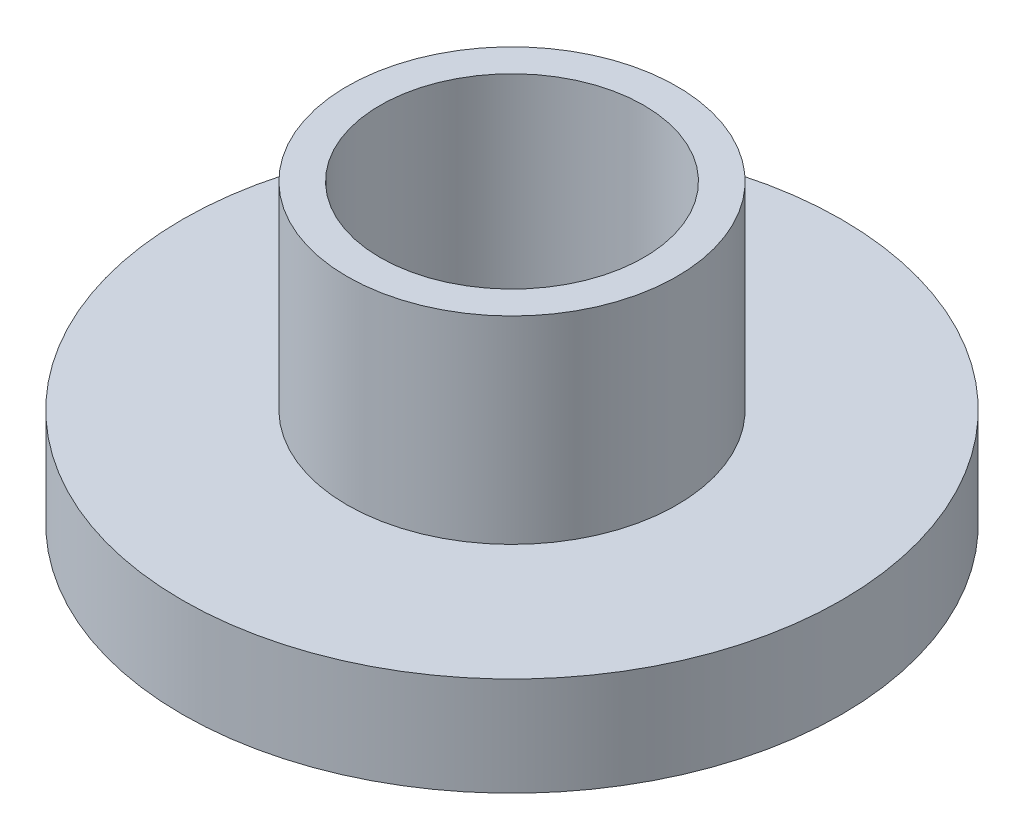
ISO-10303-21;
HEADER;
FILE_DESCRIPTION(('STEP AP214'),'2;1');
FILE_NAME('part.step','',(''),(''),'','','');
FILE_SCHEMA(('AUTOMOTIVE_DESIGN { 1 0 10303 214 1 1 1 1 }'));
ENDSEC;
DATA;
#1=APPLICATION_CONTEXT('core data for automotive mechanical design processes');
#2=APPLICATION_PROTOCOL_DEFINITION('international standard','automotive_design',2000,#1);
#3=PRODUCT_CONTEXT('',#1,'mechanical');
#4=PRODUCT('Part','Part','',(#3));
#5=PRODUCT_RELATED_PRODUCT_CATEGORY('part','',(#4));
#6=PRODUCT_DEFINITION_FORMATION('','',#4);
#7=PRODUCT_DEFINITION_CONTEXT('part definition',#1,'design');
#8=PRODUCT_DEFINITION('design','',#6,#7);
#9=PRODUCT_DEFINITION_SHAPE('','',#8);
#10=(LENGTH_UNIT() NAMED_UNIT(*) SI_UNIT(.MILLI.,.METRE.));
#11=(NAMED_UNIT(*) PLANE_ANGLE_UNIT() SI_UNIT($,.RADIAN.));
#12=(NAMED_UNIT(*) SI_UNIT($,.STERADIAN.) SOLID_ANGLE_UNIT());
#13=UNCERTAINTY_MEASURE_WITH_UNIT(LENGTH_MEASURE(1.E-05),#10,'distance_accuracy_value','');
#14=(GEOMETRIC_REPRESENTATION_CONTEXT(3) GLOBAL_UNCERTAINTY_ASSIGNED_CONTEXT((#13)) GLOBAL_UNIT_ASSIGNED_CONTEXT((#10,
#11,#12)) REPRESENTATION_CONTEXT('',''));
#15=CARTESIAN_POINT('',(0.,0.,0.));
#16=DIRECTION('',(0.,0.,1.));
#17=DIRECTION('',(1.,0.,0.));
#18=AXIS2_PLACEMENT_3D('',#15,#16,#17);
#19=CARTESIAN_POINT('',(0.,1.5,0.));
#20=DIRECTION('',(0.,1.,0.));
#21=DIRECTION('',(0.,0.,1.));
#22=AXIS2_PLACEMENT_3D('',#19,#20,#21);
#23=PLANE('',#22);
#24=CARTESIAN_POINT('',(0.,1.5,0.));
#25=DIRECTION('',(0.,1.,0.));
#26=DIRECTION('',(0.,0.,1.));
#27=AXIS2_PLACEMENT_3D('',#24,#25,#26);
#28=CIRCLE('',#27,5.);
#29=CARTESIAN_POINT('',(0.,1.5,5.));
#30=VERTEX_POINT('',#29);
#31=EDGE_CURVE('E10',#30,#30,#28,.T.);
#32=ORIENTED_EDGE('',*,*,#31,.T.);
#33=EDGE_LOOP('',(#32));
#34=FACE_BOUND('',#33,.T.);
#35=CARTESIAN_POINT('',(0.,1.5,0.));
#36=DIRECTION('',(0.,1.,0.));
#37=DIRECTION('',(0.,0.,1.));
#38=AXIS2_PLACEMENT_3D('',#35,#36,#37);
#39=CIRCLE('',#38,2.5);
#40=CARTESIAN_POINT('',(0.,1.5,2.5));
#41=VERTEX_POINT('',#40);
#42=EDGE_CURVE('E56',#41,#41,#39,.T.);
#43=ORIENTED_EDGE('',*,*,#42,.F.);
#44=EDGE_LOOP('',(#43));
#45=FACE_BOUND('',#44,.T.);
#46=ADVANCED_FACE('F37',(#34,#45),#23,.T.);
#47=CARTESIAN_POINT('',(0.,0.,0.));
#48=DIRECTION('',(0.,1.,0.));
#49=DIRECTION('',(0.,0.,1.));
#50=AXIS2_PLACEMENT_3D('',#47,#48,#49);
#51=PLANE('',#50);
#52=CARTESIAN_POINT('',(0.,0.,0.));
#53=DIRECTION('',(0.,1.,0.));
#54=DIRECTION('',(0.,0.,1.));
#55=AXIS2_PLACEMENT_3D('',#52,#53,#54);
#56=CIRCLE('',#55,5.);
#57=CARTESIAN_POINT('',(0.,0.,5.));
#58=VERTEX_POINT('',#57);
#59=EDGE_CURVE('E41',#58,#58,#56,.T.);
#60=ORIENTED_EDGE('',*,*,#59,.F.);
#61=EDGE_LOOP('',(#60));
#62=FACE_BOUND('',#61,.T.);
#63=CARTESIAN_POINT('',(0.,0.,0.));
#64=DIRECTION('',(0.,1.,0.));
#65=DIRECTION('',(0.,0.,1.));
#66=AXIS2_PLACEMENT_3D('',#63,#64,#65);
#67=CIRCLE('',#66,2.);
#68=CARTESIAN_POINT('',(0.,0.,2.));
#69=VERTEX_POINT('',#68);
#70=EDGE_CURVE('E50',#69,#69,#67,.T.);
#71=ORIENTED_EDGE('',*,*,#70,.T.);
#72=EDGE_LOOP('',(#71));
#73=FACE_BOUND('',#72,.T.);
#74=ADVANCED_FACE('F84',(#62,#73),#51,.F.);
#75=CARTESIAN_POINT('',(0.,1.5,0.));
#76=DIRECTION('',(0.,-1.,0.));
#77=DIRECTION('',(0.,0.,-1.));
#78=AXIS2_PLACEMENT_3D('',#75,#76,#77);
#79=CYLINDRICAL_SURFACE('',#78,5.);
#80=ORIENTED_EDGE('',*,*,#31,.F.);
#81=EDGE_LOOP('',(#80));
#82=FACE_BOUND('',#81,.T.);
#83=ORIENTED_EDGE('',*,*,#59,.T.);
#84=EDGE_LOOP('',(#83));
#85=FACE_BOUND('',#84,.T.);
#86=ADVANCED_FACE('F39',(#82,#85),#79,.T.);
#87=CARTESIAN_POINT('',(0.,1.5,0.));
#88=DIRECTION('',(0.,-1.,0.));
#89=DIRECTION('',(0.,0.,-1.));
#90=AXIS2_PLACEMENT_3D('',#87,#88,#89);
#91=CYLINDRICAL_SURFACE('',#90,2.);
#92=ORIENTED_EDGE('',*,*,#70,.F.);
#93=EDGE_LOOP('',(#92));
#94=FACE_BOUND('',#93,.T.);
#95=CARTESIAN_POINT('',(0.,4.5,0.));
#96=DIRECTION('',(0.,1.,0.));
#97=DIRECTION('',(0.,0.,1.));
#98=AXIS2_PLACEMENT_3D('',#95,#96,#97);
#99=CIRCLE('',#98,2.);
#100=CARTESIAN_POINT('',(0.,4.5,2.));
#101=VERTEX_POINT('',#100);
#102=EDGE_CURVE('E60',#101,#101,#99,.T.);
#103=ORIENTED_EDGE('',*,*,#102,.T.);
#104=EDGE_LOOP('',(#103));
#105=FACE_BOUND('',#104,.T.);
#106=ADVANCED_FACE('F68',(#94,#105),#91,.F.);
#107=CARTESIAN_POINT('',(0.,4.5,0.));
#108=DIRECTION('',(0.,1.,0.));
#109=DIRECTION('',(0.,0.,1.));
#110=AXIS2_PLACEMENT_3D('',#107,#108,#109);
#111=PLANE('',#110);
#112=CARTESIAN_POINT('',(0.,4.5,0.));
#113=DIRECTION('',(0.,1.,0.));
#114=DIRECTION('',(0.,0.,1.));
#115=AXIS2_PLACEMENT_3D('',#112,#113,#114);
#116=CIRCLE('',#115,2.5);
#117=CARTESIAN_POINT('',(0.,4.5,2.5));
#118=VERTEX_POINT('',#117);
#119=EDGE_CURVE('E55',#118,#118,#116,.T.);
#120=ORIENTED_EDGE('',*,*,#119,.T.);
#121=EDGE_LOOP('',(#120));
#122=FACE_BOUND('',#121,.T.);
#123=ORIENTED_EDGE('',*,*,#102,.F.);
#124=EDGE_LOOP('',(#123));
#125=FACE_BOUND('',#124,.T.);
#126=ADVANCED_FACE('F70',(#122,#125),#111,.T.);
#127=CARTESIAN_POINT('',(0.,4.5,0.));
#128=DIRECTION('',(0.,-1.,0.));
#129=DIRECTION('',(0.,0.,-1.));
#130=AXIS2_PLACEMENT_3D('',#127,#128,#129);
#131=CYLINDRICAL_SURFACE('',#130,2.5);
#132=ORIENTED_EDGE('',*,*,#119,.F.);
#133=EDGE_LOOP('',(#132));
#134=FACE_BOUND('',#133,.T.);
#135=ORIENTED_EDGE('',*,*,#42,.T.);
#136=EDGE_LOOP('',(#135));
#137=FACE_BOUND('',#136,.T.);
#138=ADVANCED_FACE('F72',(#134,#137),#131,.T.);
#139=CLOSED_SHELL('',(#46,#74,#86,#106,#126,#138));
#140=MANIFOLD_SOLID_BREP('B2',#139);
#141=ADVANCED_BREP_SHAPE_REPRESENTATION('',(#18,#140),#14);
#142=SHAPE_DEFINITION_REPRESENTATION(#9,#141);
ENDSEC;
END-ISO-10303-21;
